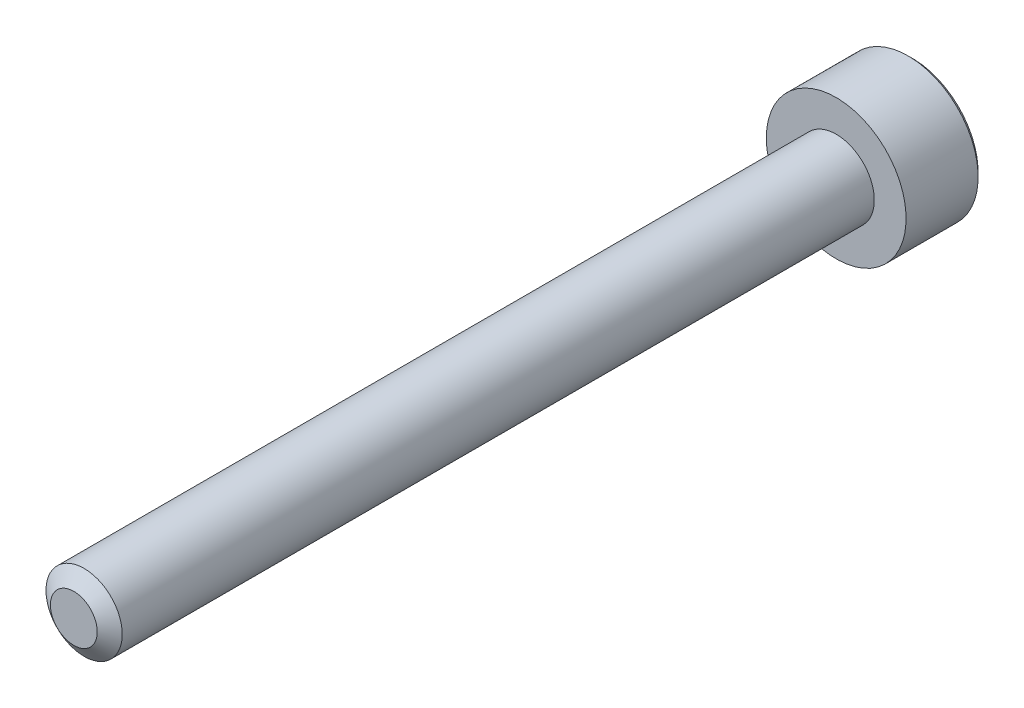
ISO-10303-21;
HEADER;
FILE_DESCRIPTION(('STEP AP214'),'2;1');
FILE_NAME('part.step','',(''),(''),'','','');
FILE_SCHEMA(('AUTOMOTIVE_DESIGN { 1 0 10303 214 1 1 1 1 }'));
ENDSEC;
DATA;
#1=APPLICATION_CONTEXT('core data for automotive mechanical design processes');
#2=APPLICATION_PROTOCOL_DEFINITION('international standard','automotive_design',2000,#1);
#3=PRODUCT_CONTEXT('',#1,'mechanical');
#4=PRODUCT('Part','Part','',(#3));
#5=PRODUCT_RELATED_PRODUCT_CATEGORY('part','',(#4));
#6=PRODUCT_DEFINITION_FORMATION('','',#4);
#7=PRODUCT_DEFINITION_CONTEXT('part definition',#1,'design');
#8=PRODUCT_DEFINITION('design','',#6,#7);
#9=PRODUCT_DEFINITION_SHAPE('','',#8);
#10=(LENGTH_UNIT() NAMED_UNIT(*) SI_UNIT(.MILLI.,.METRE.));
#11=(NAMED_UNIT(*) PLANE_ANGLE_UNIT() SI_UNIT($,.RADIAN.));
#12=(NAMED_UNIT(*) SI_UNIT($,.STERADIAN.) SOLID_ANGLE_UNIT());
#13=UNCERTAINTY_MEASURE_WITH_UNIT(LENGTH_MEASURE(1.E-05),#10,'distance_accuracy_value','');
#14=(GEOMETRIC_REPRESENTATION_CONTEXT(3) GLOBAL_UNCERTAINTY_ASSIGNED_CONTEXT((#13)) GLOBAL_UNIT_ASSIGNED_CONTEXT((#10,
#11,#12)) REPRESENTATION_CONTEXT('',''));
#15=CARTESIAN_POINT('',(0.,0.,0.));
#16=DIRECTION('',(0.,0.,1.));
#17=DIRECTION('',(1.,0.,0.));
#18=AXIS2_PLACEMENT_3D('',#15,#16,#17);
#19=CARTESIAN_POINT('',(0.,0.,18.));
#20=DIRECTION('',(0.,0.,1.));
#21=DIRECTION('',(1.,0.,0.));
#22=AXIS2_PLACEMENT_3D('',#19,#20,#21);
#23=PLANE('',#22);
#24=CARTESIAN_POINT('',(0.,0.,18.));
#25=DIRECTION('',(0.,0.,1.));
#26=DIRECTION('',(1.,0.,0.));
#27=AXIS2_PLACEMENT_3D('',#24,#25,#26);
#28=CIRCLE('',#27,0.921240473580834);
#29=CARTESIAN_POINT('',(0.921240473580837,0.,18.));
#30=VERTEX_POINT('',#29);
#31=EDGE_CURVE('E11',#30,#30,#28,.T.);
#32=ORIENTED_EDGE('',*,*,#31,.T.);
#33=EDGE_LOOP('',(#32));
#34=FACE_BOUND('',#33,.T.);
#35=ADVANCED_FACE('F16',(#34),#23,.T.);
#36=CARTESIAN_POINT('',(0.,0.,18.));
#37=DIRECTION('',(0.,0.,-1.));
#38=DIRECTION('',(-1.,0.,0.));
#39=AXIS2_PLACEMENT_3D('',#36,#37,#38);
#40=CONICAL_SURFACE('',#39,0.921240473580834,0.959931088596884);
#41=CARTESIAN_POINT('',(0.,0.,17.5947482167906));
#42=DIRECTION('',(0.,0.,-1.));
#43=DIRECTION('',(1.,0.,0.));
#44=AXIS2_PLACEMENT_3D('',#41,#42,#43);
#45=CIRCLE('',#44,1.5);
#46=CARTESIAN_POINT('',(-1.5,0.,17.5947482167906));
#47=VERTEX_POINT('',#46);
#48=CARTESIAN_POINT('',(1.5,0.,17.5947482167906));
#49=VERTEX_POINT('',#48);
#50=EDGE_CURVE('E190',#47,#49,#45,.T.);
#51=ORIENTED_EDGE('',*,*,#50,.F.);
#52=CARTESIAN_POINT('',(0.,0.,17.5947482167906));
#53=DIRECTION('',(0.,0.,-1.));
#54=DIRECTION('',(1.,0.,0.));
#55=AXIS2_PLACEMENT_3D('',#52,#53,#54);
#56=CIRCLE('',#55,1.5);
#57=EDGE_CURVE('E193',#49,#47,#56,.T.);
#58=ORIENTED_EDGE('',*,*,#57,.F.);
#59=DIRECTION('',(-0.819152044288993,0.,0.573576436351044));
#60=VECTOR('',#59,1.);
#61=CARTESIAN_POINT('',(0.921240473580837,0.,18.));
#62=LINE('',#61,#60);
#63=EDGE_CURVE('E24',#49,#30,#62,.T.);
#64=ORIENTED_EDGE('',*,*,#63,.T.);
#65=ORIENTED_EDGE('',*,*,#31,.F.);
#66=ORIENTED_EDGE('',*,*,#63,.F.);
#67=EDGE_LOOP('',(#51,#58,#64,#65,#66));
#68=FACE_BOUND('',#67,.T.);
#69=ADVANCED_FACE('F328',(#68),#40,.T.);
#70=CARTESIAN_POINT('',(0.,0.,-12.));
#71=DIRECTION('',(0.,0.,1.));
#72=DIRECTION('',(1.,0.,0.));
#73=AXIS2_PLACEMENT_3D('',#70,#71,#72);
#74=CYLINDRICAL_SURFACE('',#73,1.5);
#75=ORIENTED_EDGE('',*,*,#50,.T.);
#76=ORIENTED_EDGE('',*,*,#57,.T.);
#77=DIRECTION('',(0.,0.,-1.));
#78=VECTOR('',#77,1.);
#79=CARTESIAN_POINT('',(-1.5,0.,-12.));
#80=LINE('',#79,#78);
#81=CARTESIAN_POINT('',(-1.5,0.,-12.));
#82=VERTEX_POINT('',#81);
#83=EDGE_CURVE('E196',#47,#82,#80,.T.);
#84=ORIENTED_EDGE('',*,*,#83,.T.);
#85=CARTESIAN_POINT('',(0.,0.,-12.));
#86=DIRECTION('',(0.,0.,1.));
#87=DIRECTION('',(1.,0.,0.));
#88=AXIS2_PLACEMENT_3D('',#85,#86,#87);
#89=CIRCLE('',#88,1.5);
#90=EDGE_CURVE('E178',#82,#82,#89,.T.);
#91=ORIENTED_EDGE('',*,*,#90,.T.);
#92=ORIENTED_EDGE('',*,*,#83,.F.);
#93=EDGE_LOOP('',(#75,#76,#84,#91,#92));
#94=FACE_BOUND('',#93,.T.);
#95=ADVANCED_FACE('F332',(#94),#74,.T.);
#96=CARTESIAN_POINT('',(0.,0.,-15.));
#97=DIRECTION('',(0.,0.,1.));
#98=DIRECTION('',(1.,0.,0.));
#99=AXIS2_PLACEMENT_3D('',#96,#97,#98);
#100=CONICAL_SURFACE('',#99,2.585,0.785398163397446);
#101=CARTESIAN_POINT('',(0.,0.,-14.835));
#102=DIRECTION('',(0.,0.,1.));
#103=DIRECTION('',(-1.,0.,0.));
#104=AXIS2_PLACEMENT_3D('',#101,#102,#103);
#105=CIRCLE('',#104,2.75);
#106=CARTESIAN_POINT('',(-2.75,0.,-14.835));
#107=VERTEX_POINT('',#106);
#108=EDGE_CURVE('E212',#107,#107,#105,.T.);
#109=ORIENTED_EDGE('',*,*,#108,.F.);
#110=DIRECTION('',(0.707106781186546,0.,-0.707106781186549));
#111=VECTOR('',#110,1.);
#112=CARTESIAN_POINT('',(-2.585,0.,-15.));
#113=LINE('',#112,#111);
#114=CARTESIAN_POINT('',(-2.585,0.,-15.));
#115=VERTEX_POINT('',#114);
#116=EDGE_CURVE('E189',#107,#115,#113,.T.);
#117=ORIENTED_EDGE('',*,*,#116,.T.);
#118=CARTESIAN_POINT('',(0.,0.,-15.));
#119=DIRECTION('',(0.,0.,-1.));
#120=DIRECTION('',(-1.,0.,0.));
#121=AXIS2_PLACEMENT_3D('',#118,#119,#120);
#122=CIRCLE('',#121,2.585);
#123=EDGE_CURVE('E182',#115,#115,#122,.T.);
#124=ORIENTED_EDGE('',*,*,#123,.F.);
#125=ORIENTED_EDGE('',*,*,#116,.F.);
#126=EDGE_LOOP('',(#109,#117,#124,#125));
#127=FACE_BOUND('',#126,.T.);
#128=ADVANCED_FACE('F336',(#127),#100,.T.);
#129=CARTESIAN_POINT('',(0.,0.,-15.));
#130=DIRECTION('',(0.,0.,-1.));
#131=DIRECTION('',(-1.,0.,0.));
#132=AXIS2_PLACEMENT_3D('',#129,#130,#131);
#133=CONICAL_SURFACE('',#132,1.44337567297406,0.78539816339745);
#134=CARTESIAN_POINT('',(-1.25,-0.72168783648703,-15.));
#135=CARTESIAN_POINT('',(-1.25,0.,-14.6391560817565));
#136=CARTESIAN_POINT('',(-1.25,0.721687836487026,-15.));
#137=(BOUNDED_CURVE() B_SPLINE_CURVE(2,(#134,#135,#136),.UNSPECIFIED.,.F.,
.F.) B_SPLINE_CURVE_WITH_KNOTS((3,3),(-0.355324362692751,-0.127655147271297),
.UNSPECIFIED.) CURVE() GEOMETRIC_REPRESENTATION_ITEM() RATIONAL_B_SPLINE_CURVE((1.37128129211021,
1.58341924626905,1.37128129211021)) REPRESENTATION_ITEM(''));
#138=CARTESIAN_POINT('',(-1.25,-0.721687836487032,-15.));
#139=VERTEX_POINT('',#138);
#140=CARTESIAN_POINT('',(-1.25,0.721687836487032,-15.));
#141=VERTEX_POINT('',#140);
#142=EDGE_CURVE('E233',#139,#141,#137,.T.);
#143=ORIENTED_EDGE('',*,*,#142,.F.);
#144=CARTESIAN_POINT('',(0.,0.,-15.));
#145=DIRECTION('',(0.,0.,-1.));
#146=DIRECTION('',(-1.,0.,0.));
#147=AXIS2_PLACEMENT_3D('',#144,#145,#146);
#148=CIRCLE('',#147,1.44337567297406);
#149=EDGE_CURVE('E186',#139,#141,#148,.T.);
#150=ORIENTED_EDGE('',*,*,#149,.T.);
#151=EDGE_LOOP('',(#143,#150));
#152=FACE_BOUND('',#151,.T.);
#153=ADVANCED_FACE('F341',(#152),#133,.F.);
#154=CARTESIAN_POINT('',(0.,0.,-15.));
#155=DIRECTION('',(0.,0.,-1.));
#156=DIRECTION('',(0.,-1.,0.));
#157=AXIS2_PLACEMENT_3D('',#154,#155,#156);
#158=PLANE('',#157);
#159=CARTESIAN_POINT('',(0.,0.,-15.));
#160=DIRECTION('',(0.,0.,-1.));
#161=DIRECTION('',(-1.,0.,0.));
#162=AXIS2_PLACEMENT_3D('',#159,#160,#161);
#163=CIRCLE('',#162,1.44337567297406);
#164=CARTESIAN_POINT('',(0.,1.44337567297407,-15.));
#165=VERTEX_POINT('',#164);
#166=EDGE_CURVE('E123',#141,#165,#163,.T.);
#167=ORIENTED_EDGE('',*,*,#166,.F.);
#168=ORIENTED_EDGE('',*,*,#149,.F.);
#169=CARTESIAN_POINT('',(0.,0.,-15.));
#170=DIRECTION('',(0.,0.,-1.));
#171=DIRECTION('',(-1.,0.,0.));
#172=AXIS2_PLACEMENT_3D('',#169,#170,#171);
#173=CIRCLE('',#172,1.44337567297406);
#174=CARTESIAN_POINT('',(0.,-1.44337567297407,-15.));
#175=VERTEX_POINT('',#174);
#176=EDGE_CURVE('E167',#175,#139,#173,.T.);
#177=ORIENTED_EDGE('',*,*,#176,.F.);
#178=CARTESIAN_POINT('',(0.,0.,-15.));
#179=DIRECTION('',(0.,0.,-1.));
#180=DIRECTION('',(-1.,0.,0.));
#181=AXIS2_PLACEMENT_3D('',#178,#179,#180);
#182=CIRCLE('',#181,1.44337567297406);
#183=CARTESIAN_POINT('',(1.25,-0.721687836487032,-15.));
#184=VERTEX_POINT('',#183);
#185=EDGE_CURVE('E171',#184,#175,#182,.T.);
#186=ORIENTED_EDGE('',*,*,#185,.F.);
#187=CARTESIAN_POINT('',(0.,0.,-15.));
#188=DIRECTION('',(0.,0.,-1.));
#189=DIRECTION('',(-1.,0.,0.));
#190=AXIS2_PLACEMENT_3D('',#187,#188,#189);
#191=CIRCLE('',#190,1.44337567297406);
#192=CARTESIAN_POINT('',(1.25,0.721687836487033,-15.));
#193=VERTEX_POINT('',#192);
#194=EDGE_CURVE('E174',#193,#184,#191,.T.);
#195=ORIENTED_EDGE('',*,*,#194,.F.);
#196=CARTESIAN_POINT('',(0.,0.,-15.));
#197=DIRECTION('',(0.,0.,-1.));
#198=DIRECTION('',(-1.,0.,0.));
#199=AXIS2_PLACEMENT_3D('',#196,#197,#198);
#200=CIRCLE('',#199,1.44337567297406);
#201=EDGE_CURVE('E177',#165,#193,#200,.T.);
#202=ORIENTED_EDGE('',*,*,#201,.F.);
#203=EDGE_LOOP('',(#167,#168,#177,#186,#195,#202));
#204=FACE_BOUND('',#203,.T.);
#205=ORIENTED_EDGE('',*,*,#123,.T.);
#206=EDGE_LOOP('',(#205));
#207=FACE_BOUND('',#206,.T.);
#208=ADVANCED_FACE('F312',(#204,#207),#158,.T.);
#209=CARTESIAN_POINT('',(0.,0.,-12.));
#210=DIRECTION('',(0.,0.,-1.));
#211=DIRECTION('',(0.,-1.,0.));
#212=AXIS2_PLACEMENT_3D('',#209,#210,#211);
#213=PLANE('',#212);
#214=ORIENTED_EDGE('',*,*,#90,.F.);
#215=EDGE_LOOP('',(#214));
#216=FACE_BOUND('',#215,.T.);
#217=CARTESIAN_POINT('',(0.,0.,-12.));
#218=DIRECTION('',(0.,0.,1.));
#219=DIRECTION('',(1.,0.,0.));
#220=AXIS2_PLACEMENT_3D('',#217,#218,#219);
#221=CIRCLE('',#220,2.75);
#222=CARTESIAN_POINT('',(-2.75,0.,-12.));
#223=VERTEX_POINT('',#222);
#224=EDGE_CURVE('E213',#223,#223,#221,.T.);
#225=ORIENTED_EDGE('',*,*,#224,.T.);
#226=EDGE_LOOP('',(#225));
#227=FACE_BOUND('',#226,.T.);
#228=ADVANCED_FACE('F325',(#216,#227),#213,.F.);
#229=CARTESIAN_POINT('',(0.,0.,-15.));
#230=DIRECTION('',(0.,0.,-1.));
#231=DIRECTION('',(-1.,0.,0.));
#232=AXIS2_PLACEMENT_3D('',#229,#230,#231);
#233=CONICAL_SURFACE('',#232,1.44337567297406,0.78539816339745);
#234=ORIENTED_EDGE('',*,*,#201,.T.);
#235=CARTESIAN_POINT('',(0.,1.44337567297406,-15.));
#236=CARTESIAN_POINT('',(0.625000000000001,1.08253175473055,-14.6391560817565));
#237=CARTESIAN_POINT('',(1.25,0.721687836487035,-15.));
#238=(BOUNDED_CURVE() B_SPLINE_CURVE(2,(#235,#236,#237),.UNSPECIFIED.,.F.,
.F.) B_SPLINE_CURVE_WITH_KNOTS((3,3),(-0.35532436269275,-0.127655147271297),
.UNSPECIFIED.) CURVE() GEOMETRIC_REPRESENTATION_ITEM() RATIONAL_B_SPLINE_CURVE((1.37128129211021,
1.58341924626904,1.3712812921102)) REPRESENTATION_ITEM(''));
#239=EDGE_CURVE('E124',#165,#193,#238,.T.);
#240=ORIENTED_EDGE('',*,*,#239,.F.);
#241=EDGE_LOOP('',(#234,#240));
#242=FACE_BOUND('',#241,.T.);
#243=ADVANCED_FACE('F309',(#242),#233,.F.);
#244=CARTESIAN_POINT('',(0.,0.,-15.));
#245=DIRECTION('',(0.,0.,-1.));
#246=DIRECTION('',(1.,0.,0.));
#247=AXIS2_PLACEMENT_3D('',#244,#245,#246);
#248=CONICAL_SURFACE('',#247,1.44337567297406,0.78539816339745);
#249=ORIENTED_EDGE('',*,*,#194,.T.);
#250=CARTESIAN_POINT('',(1.25,0.721687836487025,-15.));
#251=CARTESIAN_POINT('',(1.25,0.,-14.6391560817565));
#252=CARTESIAN_POINT('',(1.25,-0.721687836487027,-15.));
#253=(BOUNDED_CURVE() B_SPLINE_CURVE(2,(#250,#251,#252),.UNSPECIFIED.,.F.,
.F.) B_SPLINE_CURVE_WITH_KNOTS((3,3),(-0.35532436269275,-0.127655147271297),
.UNSPECIFIED.) CURVE() GEOMETRIC_REPRESENTATION_ITEM() RATIONAL_B_SPLINE_CURVE((1.3712812921102,
1.58341924626904,1.3712812921102)) REPRESENTATION_ITEM(''));
#254=EDGE_CURVE('E135',#193,#184,#253,.T.);
#255=ORIENTED_EDGE('',*,*,#254,.F.);
#256=EDGE_LOOP('',(#249,#255));
#257=FACE_BOUND('',#256,.T.);
#258=ADVANCED_FACE('F315',(#257),#248,.F.);
#259=CARTESIAN_POINT('',(0.,0.,-15.));
#260=DIRECTION('',(0.,0.,-1.));
#261=DIRECTION('',(-1.,0.,0.));
#262=AXIS2_PLACEMENT_3D('',#259,#260,#261);
#263=CONICAL_SURFACE('',#262,1.44337567297406,0.78539816339745);
#264=ORIENTED_EDGE('',*,*,#185,.T.);
#265=CARTESIAN_POINT('',(1.25,-0.721687836487034,-15.));
#266=CARTESIAN_POINT('',(0.625000000000001,-1.08253175473055,-14.6391560817565));
#267=CARTESIAN_POINT('',(0.,-1.44337567297406,-15.));
#268=(BOUNDED_CURVE() B_SPLINE_CURVE(2,(#265,#266,#267),.UNSPECIFIED.,.F.,
.F.) B_SPLINE_CURVE_WITH_KNOTS((3,3),(-0.355324362692751,-0.127655147271297),
.UNSPECIFIED.) CURVE() GEOMETRIC_REPRESENTATION_ITEM() RATIONAL_B_SPLINE_CURVE((1.37128129211021,
1.58341924626905,1.37128129211021)) REPRESENTATION_ITEM(''));
#269=EDGE_CURVE('E148',#184,#175,#268,.T.);
#270=ORIENTED_EDGE('',*,*,#269,.F.);
#271=EDGE_LOOP('',(#264,#270));
#272=FACE_BOUND('',#271,.T.);
#273=ADVANCED_FACE('F317',(#272),#263,.F.);
#274=CARTESIAN_POINT('',(0.,0.,-15.));
#275=DIRECTION('',(0.,0.,-1.));
#276=DIRECTION('',(-1.,0.,0.));
#277=AXIS2_PLACEMENT_3D('',#274,#275,#276);
#278=CONICAL_SURFACE('',#277,1.44337567297406,0.78539816339745);
#279=ORIENTED_EDGE('',*,*,#176,.T.);
#280=CARTESIAN_POINT('',(0.,-1.44337567297406,-15.));
#281=CARTESIAN_POINT('',(-0.625000000000001,-1.08253175473055,-14.6391560817565));
#282=CARTESIAN_POINT('',(-1.25,-0.721687836487035,-15.));
#283=(BOUNDED_CURVE() B_SPLINE_CURVE(2,(#280,#281,#282),.UNSPECIFIED.,.F.,
.F.) B_SPLINE_CURVE_WITH_KNOTS((3,3),(-0.35532436269275,-0.127655147271297),
.UNSPECIFIED.) CURVE() GEOMETRIC_REPRESENTATION_ITEM() RATIONAL_B_SPLINE_CURVE((1.37128129211021,
1.58341924626904,1.3712812921102)) REPRESENTATION_ITEM(''));
#284=EDGE_CURVE('E229',#175,#139,#283,.T.);
#285=ORIENTED_EDGE('',*,*,#284,.F.);
#286=EDGE_LOOP('',(#279,#285));
#287=FACE_BOUND('',#286,.T.);
#288=ADVANCED_FACE('F287',(#287),#278,.F.);
#289=CARTESIAN_POINT('',(0.,0.,-15.));
#290=DIRECTION('',(0.,0.,-1.));
#291=DIRECTION('',(-1.,0.,0.));
#292=AXIS2_PLACEMENT_3D('',#289,#290,#291);
#293=CONICAL_SURFACE('',#292,1.44337567297406,0.78539816339745);
#294=ORIENTED_EDGE('',*,*,#166,.T.);
#295=CARTESIAN_POINT('',(-1.25,0.721687836487036,-15.));
#296=CARTESIAN_POINT('',(-0.625,1.08253175473055,-14.6391560817565));
#297=CARTESIAN_POINT('',(0.,1.44337567297406,-15.));
#298=(BOUNDED_CURVE() B_SPLINE_CURVE(2,(#295,#296,#297),.UNSPECIFIED.,.F.,
.F.) B_SPLINE_CURVE_WITH_KNOTS((3,3),(-0.35532436269275,-0.127655147271297),
.UNSPECIFIED.) CURVE() GEOMETRIC_REPRESENTATION_ITEM() RATIONAL_B_SPLINE_CURVE((1.3712812921102,
1.58341924626904,1.3712812921102)) REPRESENTATION_ITEM(''));
#299=EDGE_CURVE('E224',#141,#165,#298,.T.);
#300=ORIENTED_EDGE('',*,*,#299,.F.);
#301=EDGE_LOOP('',(#294,#300));
#302=FACE_BOUND('',#301,.T.);
#303=ADVANCED_FACE('F305',(#302),#293,.F.);
#304=CARTESIAN_POINT('',(1.25,2.1650635094611,-13.125));
#305=DIRECTION('',(0.,0.,-1.));
#306=DIRECTION('',(0.,-1.,0.));
#307=AXIS2_PLACEMENT_3D('',#304,#305,#306);
#308=PLANE('',#307);
#309=DIRECTION('',(0.866025403784439,0.5,0.));
#310=VECTOR('',#309,1.);
#311=CARTESIAN_POINT('',(-1.25,0.721687836487032,-13.125));
#312=LINE('',#311,#310);
#313=CARTESIAN_POINT('',(-1.25,0.721687836487032,-13.125));
#314=VERTEX_POINT('',#313);
#315=CARTESIAN_POINT('',(0.,1.44337567297406,-13.125));
#316=VERTEX_POINT('',#315);
#317=EDGE_CURVE('E117',#314,#316,#312,.T.);
#318=ORIENTED_EDGE('',*,*,#317,.T.);
#319=DIRECTION('',(0.866025403784439,-0.5,0.));
#320=VECTOR('',#319,1.);
#321=CARTESIAN_POINT('',(0.,1.44337567297406,-13.125));
#322=LINE('',#321,#320);
#323=CARTESIAN_POINT('',(1.25,0.721687836487032,-13.125));
#324=VERTEX_POINT('',#323);
#325=EDGE_CURVE('E111',#316,#324,#322,.T.);
#326=ORIENTED_EDGE('',*,*,#325,.T.);
#327=DIRECTION('',(0.,-1.,0.));
#328=VECTOR('',#327,1.);
#329=CARTESIAN_POINT('',(1.25,0.721687836487032,-13.125));
#330=LINE('',#329,#328);
#331=CARTESIAN_POINT('',(1.25,-0.721687836487033,-13.125));
#332=VERTEX_POINT('',#331);
#333=EDGE_CURVE('E114',#324,#332,#330,.T.);
#334=ORIENTED_EDGE('',*,*,#333,.T.);
#335=DIRECTION('',(-0.866025403784439,-0.5,0.));
#336=VECTOR('',#335,1.);
#337=CARTESIAN_POINT('',(1.25,-0.721687836487033,-13.125));
#338=LINE('',#337,#336);
#339=CARTESIAN_POINT('',(0.,-1.44337567297406,-13.125));
#340=VERTEX_POINT('',#339);
#341=EDGE_CURVE('E142',#332,#340,#338,.T.);
#342=ORIENTED_EDGE('',*,*,#341,.T.);
#343=DIRECTION('',(-0.866025403784439,0.5,0.));
#344=VECTOR('',#343,1.);
#345=CARTESIAN_POINT('',(0.,-1.44337567297406,-13.125));
#346=LINE('',#345,#344);
#347=CARTESIAN_POINT('',(-1.25,-0.721687836487032,-13.125));
#348=VERTEX_POINT('',#347);
#349=EDGE_CURVE('E254',#340,#348,#346,.T.);
#350=ORIENTED_EDGE('',*,*,#349,.T.);
#351=DIRECTION('',(0.,1.,0.));
#352=VECTOR('',#351,1.);
#353=CARTESIAN_POINT('',(-1.25,-0.721687836487032,-13.125));
#354=LINE('',#353,#352);
#355=EDGE_CURVE('E230',#348,#314,#354,.T.);
#356=ORIENTED_EDGE('',*,*,#355,.T.);
#357=EDGE_LOOP('',(#318,#326,#334,#342,#350,#356));
#358=FACE_BOUND('',#357,.T.);
#359=ADVANCED_FACE('F113',(#358),#308,.T.);
#360=CARTESIAN_POINT('',(0.,1.44337567297406,-13.125));
#361=DIRECTION('',(0.5,0.866025403784439,0.));
#362=DIRECTION('',(0.,0.,-1.));
#363=AXIS2_PLACEMENT_3D('',#360,#361,#362);
#364=PLANE('',#363);
#365=DIRECTION('',(0.,0.,-1.));
#366=VECTOR('',#365,1.);
#367=CARTESIAN_POINT('',(0.,1.44337567297406,-13.125));
#368=LINE('',#367,#366);
#369=EDGE_CURVE('E208',#316,#165,#368,.T.);
#370=ORIENTED_EDGE('',*,*,#369,.T.);
#371=ORIENTED_EDGE('',*,*,#239,.T.);
#372=DIRECTION('',(0.,0.,-1.));
#373=VECTOR('',#372,1.);
#374=CARTESIAN_POINT('',(1.25,0.721687836487032,-13.125));
#375=LINE('',#374,#373);
#376=EDGE_CURVE('E131',#324,#193,#375,.T.);
#377=ORIENTED_EDGE('',*,*,#376,.F.);
#378=ORIENTED_EDGE('',*,*,#325,.F.);
#379=EDGE_LOOP('',(#370,#371,#377,#378));
#380=FACE_BOUND('',#379,.T.);
#381=ADVANCED_FACE('F138',(#380),#364,.F.);
#382=CARTESIAN_POINT('',(1.25,0.721687836487032,-13.125));
#383=DIRECTION('',(1.,0.,0.));
#384=DIRECTION('',(0.,1.,0.));
#385=AXIS2_PLACEMENT_3D('',#382,#383,#384);
#386=PLANE('',#385);
#387=ORIENTED_EDGE('',*,*,#376,.T.);
#388=ORIENTED_EDGE('',*,*,#254,.T.);
#389=DIRECTION('',(0.,0.,-1.));
#390=VECTOR('',#389,1.);
#391=CARTESIAN_POINT('',(1.25,-0.721687836487033,-13.125));
#392=LINE('',#391,#390);
#393=EDGE_CURVE('E133',#332,#184,#392,.T.);
#394=ORIENTED_EDGE('',*,*,#393,.F.);
#395=ORIENTED_EDGE('',*,*,#333,.F.);
#396=EDGE_LOOP('',(#387,#388,#394,#395));
#397=FACE_BOUND('',#396,.T.);
#398=ADVANCED_FACE('F129',(#397),#386,.F.);
#399=CARTESIAN_POINT('',(1.25,-0.721687836487033,-13.125));
#400=DIRECTION('',(0.5,-0.866025403784439,0.));
#401=DIRECTION('',(0.,0.,-1.));
#402=AXIS2_PLACEMENT_3D('',#399,#400,#401);
#403=PLANE('',#402);
#404=ORIENTED_EDGE('',*,*,#393,.T.);
#405=ORIENTED_EDGE('',*,*,#269,.T.);
#406=DIRECTION('',(0.,0.,-1.));
#407=VECTOR('',#406,1.);
#408=CARTESIAN_POINT('',(0.,-1.44337567297406,-13.125));
#409=LINE('',#408,#407);
#410=EDGE_CURVE('E225',#340,#175,#409,.T.);
#411=ORIENTED_EDGE('',*,*,#410,.F.);
#412=ORIENTED_EDGE('',*,*,#341,.F.);
#413=EDGE_LOOP('',(#404,#405,#411,#412));
#414=FACE_BOUND('',#413,.T.);
#415=ADVANCED_FACE('F284',(#414),#403,.F.);
#416=CARTESIAN_POINT('',(0.,-1.44337567297406,-13.125));
#417=DIRECTION('',(-0.5,-0.866025403784439,0.));
#418=DIRECTION('',(-0.866025403784439,0.5,0.));
#419=AXIS2_PLACEMENT_3D('',#416,#417,#418);
#420=PLANE('',#419);
#421=ORIENTED_EDGE('',*,*,#410,.T.);
#422=ORIENTED_EDGE('',*,*,#284,.T.);
#423=DIRECTION('',(0.,0.,-1.));
#424=VECTOR('',#423,1.);
#425=CARTESIAN_POINT('',(-1.25,-0.721687836487032,-13.125));
#426=LINE('',#425,#424);
#427=EDGE_CURVE('E234',#348,#139,#426,.T.);
#428=ORIENTED_EDGE('',*,*,#427,.F.);
#429=ORIENTED_EDGE('',*,*,#349,.F.);
#430=EDGE_LOOP('',(#421,#422,#428,#429));
#431=FACE_BOUND('',#430,.T.);
#432=ADVANCED_FACE('F293',(#431),#420,.F.);
#433=CARTESIAN_POINT('',(-1.25,-0.721687836487032,-13.125));
#434=DIRECTION('',(-1.,0.,0.));
#435=DIRECTION('',(0.,0.,1.));
#436=AXIS2_PLACEMENT_3D('',#433,#434,#435);
#437=PLANE('',#436);
#438=ORIENTED_EDGE('',*,*,#427,.T.);
#439=ORIENTED_EDGE('',*,*,#142,.T.);
#440=DIRECTION('',(0.,0.,-1.));
#441=VECTOR('',#440,1.);
#442=CARTESIAN_POINT('',(-1.25,0.721687836487032,-13.125));
#443=LINE('',#442,#441);
#444=EDGE_CURVE('E219',#314,#141,#443,.T.);
#445=ORIENTED_EDGE('',*,*,#444,.F.);
#446=ORIENTED_EDGE('',*,*,#355,.F.);
#447=EDGE_LOOP('',(#438,#439,#445,#446));
#448=FACE_BOUND('',#447,.T.);
#449=ADVANCED_FACE('F297',(#448),#437,.F.);
#450=CARTESIAN_POINT('',(-1.25,0.721687836487032,-13.125));
#451=DIRECTION('',(-0.5,0.866025403784439,0.));
#452=DIRECTION('',(0.,0.,1.));
#453=AXIS2_PLACEMENT_3D('',#450,#451,#452);
#454=PLANE('',#453);
#455=ORIENTED_EDGE('',*,*,#444,.T.);
#456=ORIENTED_EDGE('',*,*,#299,.T.);
#457=ORIENTED_EDGE('',*,*,#369,.F.);
#458=ORIENTED_EDGE('',*,*,#317,.F.);
#459=EDGE_LOOP('',(#455,#456,#457,#458));
#460=FACE_BOUND('',#459,.T.);
#461=ADVANCED_FACE('F300',(#460),#454,.F.);
#462=CARTESIAN_POINT('',(0.,0.,-15.));
#463=DIRECTION('',(0.,0.,1.));
#464=DIRECTION('',(1.,0.,0.));
#465=AXIS2_PLACEMENT_3D('',#462,#463,#464);
#466=CYLINDRICAL_SURFACE('',#465,2.75);
#467=ORIENTED_EDGE('',*,*,#224,.F.);
#468=DIRECTION('',(0.,0.,-1.));
#469=VECTOR('',#468,1.);
#470=CARTESIAN_POINT('',(-2.75,0.,-15.));
#471=LINE('',#470,#469);
#472=EDGE_CURVE('E209',#223,#107,#471,.T.);
#473=ORIENTED_EDGE('',*,*,#472,.T.);
#474=ORIENTED_EDGE('',*,*,#108,.T.);
#475=ORIENTED_EDGE('',*,*,#472,.F.);
#476=EDGE_LOOP('',(#467,#473,#474,#475));
#477=FACE_BOUND('',#476,.T.);
#478=ADVANCED_FACE('F353',(#477),#466,.T.);
#479=CLOSED_SHELL('',(#35,#69,#95,#128,#153,#208,#228,#243,#258,#273,#288,#303,#359,#381,#398,
#415,#432,#449,#461,#478));
#480=MANIFOLD_SOLID_BREP('B1',#479);
#481=ADVANCED_BREP_SHAPE_REPRESENTATION('',(#18,#480),#14);
#482=SHAPE_DEFINITION_REPRESENTATION(#9,#481);
ENDSEC;
END-ISO-10303-21;
